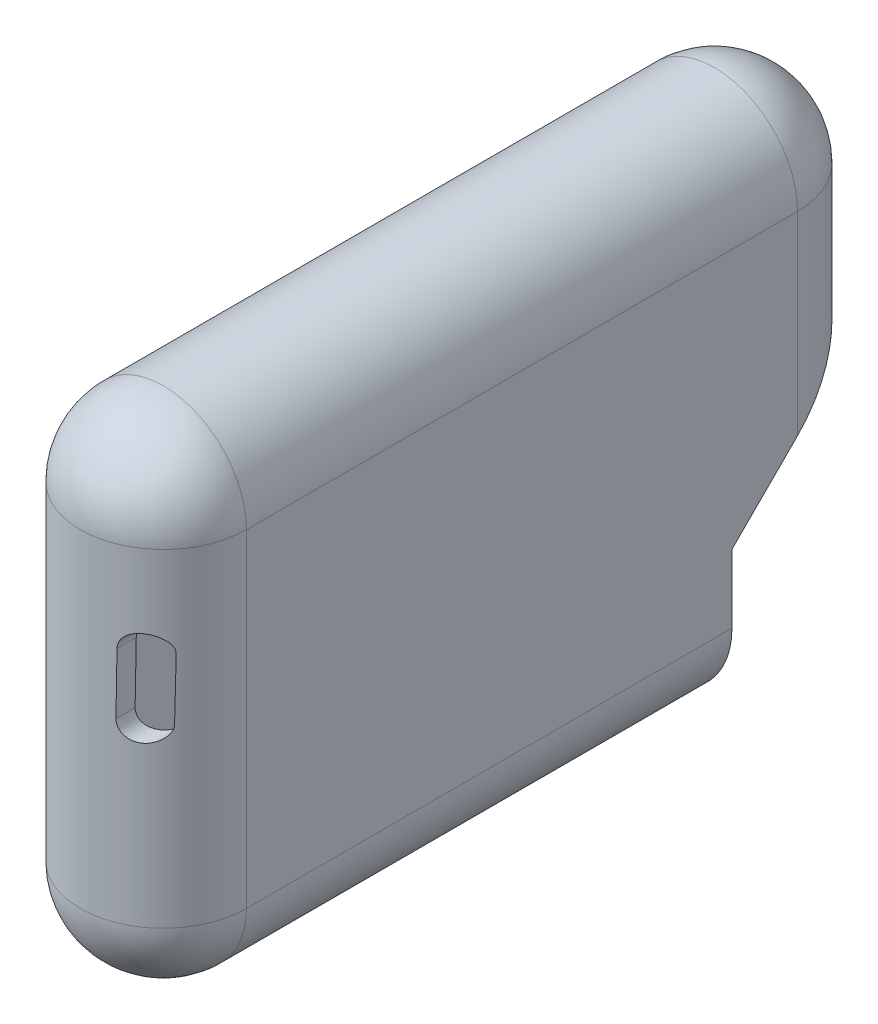
ISO-10303-21;
HEADER;
FILE_DESCRIPTION(('STEP AP214'),'2;1');
FILE_NAME('part.step','',(''),(''),'','','');
FILE_SCHEMA(('AUTOMOTIVE_DESIGN { 1 0 10303 214 1 1 1 1 }'));
ENDSEC;
DATA;
#1=APPLICATION_CONTEXT('core data for automotive mechanical design processes');
#2=APPLICATION_PROTOCOL_DEFINITION('international standard','automotive_design',2000,#1);
#3=PRODUCT_CONTEXT('',#1,'mechanical');
#4=PRODUCT('Part','Part','',(#3));
#5=PRODUCT_RELATED_PRODUCT_CATEGORY('part','',(#4));
#6=PRODUCT_DEFINITION_FORMATION('','',#4);
#7=PRODUCT_DEFINITION_CONTEXT('part definition',#1,'design');
#8=PRODUCT_DEFINITION('design','',#6,#7);
#9=PRODUCT_DEFINITION_SHAPE('','',#8);
#10=(LENGTH_UNIT() NAMED_UNIT(*) SI_UNIT(.MILLI.,.METRE.));
#11=(NAMED_UNIT(*) PLANE_ANGLE_UNIT() SI_UNIT($,.RADIAN.));
#12=(NAMED_UNIT(*) SI_UNIT($,.STERADIAN.) SOLID_ANGLE_UNIT());
#13=UNCERTAINTY_MEASURE_WITH_UNIT(LENGTH_MEASURE(1.E-05),#10,'distance_accuracy_value','');
#14=(GEOMETRIC_REPRESENTATION_CONTEXT(3) GLOBAL_UNCERTAINTY_ASSIGNED_CONTEXT((#13)) GLOBAL_UNIT_ASSIGNED_CONTEXT((#10,
#11,#12)) REPRESENTATION_CONTEXT('',''));
#15=CARTESIAN_POINT('',(0.,0.,0.));
#16=DIRECTION('',(0.,0.,1.));
#17=DIRECTION('',(1.,0.,0.));
#18=AXIS2_PLACEMENT_3D('',#15,#16,#17);
#19=CARTESIAN_POINT('',(-1.10874506068292,18.0382332785835,-55.));
#20=DIRECTION('',(0.,0.,1.));
#21=DIRECTION('',(1.,0.,0.));
#22=AXIS2_PLACEMENT_3D('',#19,#20,#21);
#23=CYLINDRICAL_SURFACE('',#22,9.5);
#24=DIRECTION('',(0.,0.,1.));
#25=VECTOR('',#24,1.);
#26=CARTESIAN_POINT('',(-10.6087450606829,18.0382332785835,-55.));
#27=LINE('',#26,#25);
#28=CARTESIAN_POINT('',(-10.6087450606829,18.0382332785835,-54.9999999999999));
#29=VERTEX_POINT('',#28);
#30=CARTESIAN_POINT('',(-10.6087450606829,18.0382332785835,7.99999999999999));
#31=VERTEX_POINT('',#30);
#32=EDGE_CURVE('E382',#29,#31,#27,.T.);
#33=ORIENTED_EDGE('',*,*,#32,.T.);
#34=CARTESIAN_POINT('',(-1.10874506068292,18.0382332785835,7.99999999999999));
#35=DIRECTION('',(0.,0.,1.));
#36=DIRECTION('',(1.,0.,0.));
#37=AXIS2_PLACEMENT_3D('',#34,#35,#36);
#38=CIRCLE('',#37,9.5);
#39=CARTESIAN_POINT('',(8.39125493931708,18.0382332785835,7.99999999999999));
#40=VERTEX_POINT('',#39);
#41=EDGE_CURVE('E346',#40,#31,#38,.T.);
#42=ORIENTED_EDGE('',*,*,#41,.F.);
#43=DIRECTION('',(0.,0.,1.));
#44=VECTOR('',#43,1.);
#45=CARTESIAN_POINT('',(8.39125493931708,18.0382332785835,-55.));
#46=LINE('',#45,#44);
#47=CARTESIAN_POINT('',(8.39125493931708,18.0382332785835,-55.));
#48=VERTEX_POINT('',#47);
#49=EDGE_CURVE('E383',#48,#40,#46,.T.);
#50=ORIENTED_EDGE('',*,*,#49,.F.);
#51=CARTESIAN_POINT('',(-1.10874506068292,18.0382332785835,-55.));
#52=DIRECTION('',(0.,0.,1.));
#53=DIRECTION('',(1.,0.,0.));
#54=AXIS2_PLACEMENT_3D('',#51,#52,#53);
#55=CIRCLE('',#54,9.5);
#56=EDGE_CURVE('E370',#48,#29,#55,.T.);
#57=ORIENTED_EDGE('',*,*,#56,.T.);
#58=EDGE_LOOP('',(#33,#42,#50,#57));
#59=FACE_BOUND('',#58,.T.);
#60=ADVANCED_FACE('F85',(#59),#23,.T.);
#61=CARTESIAN_POINT('',(8.39125493931708,18.0382332785835,-55.));
#62=DIRECTION('',(1.,0.,0.));
#63=DIRECTION('',(0.,1.,0.));
#64=AXIS2_PLACEMENT_3D('',#61,#62,#63);
#65=PLANE('',#64);
#66=DIRECTION('',(0.,-1.,0.));
#67=VECTOR('',#66,1.);
#68=CARTESIAN_POINT('',(8.39125493931708,18.0382332785835,-47.502612286271));
#69=LINE('',#68,#67);
#70=CARTESIAN_POINT('',(8.39125493931708,-11.6528868095049,-47.502612286271));
#71=VERTEX_POINT('',#70);
#72=CARTESIAN_POINT('',(8.39125493931708,-19.4617667214165,-47.502612286271));
#73=VERTEX_POINT('',#72);
#74=EDGE_CURVE('E231',#71,#73,#69,.T.);
#75=ORIENTED_EDGE('',*,*,#74,.F.);
#76=DIRECTION('',(0.,-0.707106781186548,0.707106781186547));
#77=VECTOR('',#76,1.);
#78=CARTESIAN_POINT('',(8.39125493931708,6.94136709140377,-66.0968661871797));
#79=LINE('',#78,#77);
#80=CARTESIAN_POINT('',(8.39125493931708,-4.15549909577594,-55.));
#81=VERTEX_POINT('',#80);
#82=EDGE_CURVE('E201',#81,#71,#79,.T.);
#83=ORIENTED_EDGE('',*,*,#82,.F.);
#84=DIRECTION('',(0.,1.,0.));
#85=VECTOR('',#84,1.);
#86=CARTESIAN_POINT('',(8.39125493931708,18.0382332785835,-55.));
#87=LINE('',#86,#85);
#88=EDGE_CURVE('E380',#81,#48,#87,.T.);
#89=ORIENTED_EDGE('',*,*,#88,.T.);
#90=ORIENTED_EDGE('',*,*,#49,.T.);
#91=DIRECTION('',(0.,1.,0.));
#92=VECTOR('',#91,1.);
#93=CARTESIAN_POINT('',(8.39125493931708,18.0382332785835,7.99999999999999));
#94=LINE('',#93,#92);
#95=CARTESIAN_POINT('',(8.39125493931708,-19.4617667214165,7.99999999999999));
#96=VERTEX_POINT('',#95);
#97=EDGE_CURVE('E355',#96,#40,#94,.T.);
#98=ORIENTED_EDGE('',*,*,#97,.F.);
#99=DIRECTION('',(0.,0.,1.));
#100=VECTOR('',#99,1.);
#101=CARTESIAN_POINT('',(8.39125493931708,-19.4617667214165,-55.));
#102=LINE('',#101,#100);
#103=EDGE_CURVE('E385',#73,#96,#102,.T.);
#104=ORIENTED_EDGE('',*,*,#103,.F.);
#105=EDGE_LOOP('',(#75,#83,#89,#90,#98,#104));
#106=FACE_BOUND('',#105,.T.);
#107=ADVANCED_FACE('F407',(#106),#65,.T.);
#108=CARTESIAN_POINT('',(-1.10874506068292,-19.4617667214165,-55.));
#109=DIRECTION('',(0.,0.,1.));
#110=DIRECTION('',(1.,0.,0.));
#111=AXIS2_PLACEMENT_3D('',#108,#109,#110);
#112=CYLINDRICAL_SURFACE('',#111,9.5);
#113=CARTESIAN_POINT('',(-1.10874506068292,-19.4617667214165,-47.502612286271));
#114=DIRECTION('',(0.,0.,1.));
#115=DIRECTION('',(1.,0.,0.));
#116=AXIS2_PLACEMENT_3D('',#113,#114,#115);
#117=CIRCLE('',#116,9.5);
#118=CARTESIAN_POINT('',(-10.6087450606829,-19.4617667214165,-47.502612286271));
#119=VERTEX_POINT('',#118);
#120=EDGE_CURVE('E208',#73,#119,#117,.F.);
#121=ORIENTED_EDGE('',*,*,#120,.F.);
#122=ORIENTED_EDGE('',*,*,#103,.T.);
#123=CARTESIAN_POINT('',(-1.10874506068292,-19.4617667214165,7.99999999999999));
#124=DIRECTION('',(0.,0.,1.));
#125=DIRECTION('',(1.,0.,0.));
#126=AXIS2_PLACEMENT_3D('',#123,#124,#125);
#127=CIRCLE('',#126,9.5);
#128=CARTESIAN_POINT('',(-10.6087450606829,-19.4617667214165,7.99999999999993));
#129=VERTEX_POINT('',#128);
#130=EDGE_CURVE('E352',#129,#96,#127,.T.);
#131=ORIENTED_EDGE('',*,*,#130,.F.);
#132=DIRECTION('',(0.,0.,1.));
#133=VECTOR('',#132,1.);
#134=CARTESIAN_POINT('',(-10.6087450606829,-19.4617667214165,-55.));
#135=LINE('',#134,#133);
#136=EDGE_CURVE('E387',#119,#129,#135,.T.);
#137=ORIENTED_EDGE('',*,*,#136,.F.);
#138=EDGE_LOOP('',(#121,#122,#131,#137));
#139=FACE_BOUND('',#138,.T.);
#140=ADVANCED_FACE('F411',(#139),#112,.T.);
#141=CARTESIAN_POINT('',(-10.6087450606829,18.0382332785835,-55.));
#142=DIRECTION('',(-1.,0.,0.));
#143=DIRECTION('',(0.,-1.,0.));
#144=AXIS2_PLACEMENT_3D('',#141,#142,#143);
#145=PLANE('',#144);
#146=DIRECTION('',(0.,-1.,0.));
#147=VECTOR('',#146,1.);
#148=CARTESIAN_POINT('',(-10.6087450606829,-35.0617949049496,-47.502612286271));
#149=LINE('',#148,#147);
#150=CARTESIAN_POINT('',(-10.6087450606829,-11.6528868095049,-47.502612286271));
#151=VERTEX_POINT('',#150);
#152=EDGE_CURVE('E205',#151,#119,#149,.T.);
#153=ORIENTED_EDGE('',*,*,#152,.T.);
#154=ORIENTED_EDGE('',*,*,#136,.T.);
#155=DIRECTION('',(0.,-1.,0.));
#156=VECTOR('',#155,1.);
#157=CARTESIAN_POINT('',(-10.6087450606829,18.0382332785835,7.99999999999999));
#158=LINE('',#157,#156);
#159=EDGE_CURVE('E349',#31,#129,#158,.T.);
#160=ORIENTED_EDGE('',*,*,#159,.F.);
#161=ORIENTED_EDGE('',*,*,#32,.F.);
#162=DIRECTION('',(0.,-1.,0.));
#163=VECTOR('',#162,1.);
#164=CARTESIAN_POINT('',(-10.6087450606829,18.0382332785835,-55.));
#165=LINE('',#164,#163);
#166=CARTESIAN_POINT('',(-10.6087450606829,-4.15549909577595,-55.));
#167=VERTEX_POINT('',#166);
#168=EDGE_CURVE('E216',#29,#167,#165,.T.);
#169=ORIENTED_EDGE('',*,*,#168,.T.);
#170=DIRECTION('',(0.,-0.707106781186548,0.707106781186547));
#171=VECTOR('',#170,1.);
#172=CARTESIAN_POINT('',(-10.6087450606829,-11.6528868095049,-47.502612286271));
#173=LINE('',#172,#171);
#174=EDGE_CURVE('E106',#167,#151,#173,.T.);
#175=ORIENTED_EDGE('',*,*,#174,.T.);
#176=EDGE_LOOP('',(#153,#154,#160,#161,#169,#175));
#177=FACE_BOUND('',#176,.T.);
#178=ADVANCED_FACE('F213',(#177),#145,.T.);
#179=CARTESIAN_POINT('',(-1.10874506068292,18.0382332785835,-55.));
#180=DIRECTION('',(0.,0.,1.));
#181=DIRECTION('',(1.,0.,0.));
#182=AXIS2_PLACEMENT_3D('',#179,#180,#181);
#183=CYLINDRICAL_SURFACE('',#182,7.5);
#184=DIRECTION('',(0.,0.,1.));
#185=VECTOR('',#184,1.);
#186=CARTESIAN_POINT('',(6.39125493931708,18.0382332785835,-55.));
#187=LINE('',#186,#185);
#188=CARTESIAN_POINT('',(6.39125493931708,18.0382332785835,-55.));
#189=VERTEX_POINT('',#188);
#190=CARTESIAN_POINT('',(6.39125493931708,18.0382332785835,7.99999999999999));
#191=VERTEX_POINT('',#190);
#192=EDGE_CURVE('E367',#189,#191,#187,.T.);
#193=ORIENTED_EDGE('',*,*,#192,.T.);
#194=CARTESIAN_POINT('',(-1.10874506068292,18.0382332785835,7.99999999999999));
#195=DIRECTION('',(0.,0.,1.));
#196=DIRECTION('',(1.,0.,0.));
#197=AXIS2_PLACEMENT_3D('',#194,#195,#196);
#198=CIRCLE('',#197,7.5);
#199=CARTESIAN_POINT('',(-8.60874506068292,18.0382332785835,7.99999999999994));
#200=VERTEX_POINT('',#199);
#201=EDGE_CURVE('E334',#191,#200,#198,.T.);
#202=ORIENTED_EDGE('',*,*,#201,.T.);
#203=DIRECTION('',(0.,0.,1.));
#204=VECTOR('',#203,1.);
#205=CARTESIAN_POINT('',(-8.60874506068292,18.0382332785835,-55.));
#206=LINE('',#205,#204);
#207=CARTESIAN_POINT('',(-8.60874506068292,18.0382332785835,-55.));
#208=VERTEX_POINT('',#207);
#209=EDGE_CURVE('E366',#208,#200,#206,.T.);
#210=ORIENTED_EDGE('',*,*,#209,.F.);
#211=CARTESIAN_POINT('',(-1.10874506068292,18.0382332785835,-55.));
#212=DIRECTION('',(0.,0.,1.));
#213=DIRECTION('',(1.,0.,0.));
#214=AXIS2_PLACEMENT_3D('',#211,#212,#213);
#215=CIRCLE('',#214,7.5);
#216=EDGE_CURVE('E358',#189,#208,#215,.T.);
#217=ORIENTED_EDGE('',*,*,#216,.F.);
#218=EDGE_LOOP('',(#193,#202,#210,#217));
#219=FACE_BOUND('',#218,.T.);
#220=ADVANCED_FACE('F421',(#219),#183,.F.);
#221=CARTESIAN_POINT('',(6.39125493931708,18.0382332785835,-55.));
#222=DIRECTION('',(1.,0.,0.));
#223=DIRECTION('',(0.,1.,0.));
#224=AXIS2_PLACEMENT_3D('',#221,#222,#223);
#225=PLANE('',#224);
#226=DIRECTION('',(0.,-0.707106781186548,0.707106781186547));
#227=VECTOR('',#226,1.);
#228=CARTESIAN_POINT('',(6.39125493931708,6.94136709140376,-66.0968661871797));
#229=LINE('',#228,#227);
#230=CARTESIAN_POINT('',(6.39125493931708,-4.15549909577594,-55.));
#231=VERTEX_POINT('',#230);
#232=CARTESIAN_POINT('',(6.39125493931708,-11.6528868095049,-47.502612286271));
#233=VERTEX_POINT('',#232);
#234=EDGE_CURVE('E99',#231,#233,#229,.T.);
#235=ORIENTED_EDGE('',*,*,#234,.T.);
#236=DIRECTION('',(0.,-1.,0.));
#237=VECTOR('',#236,1.);
#238=CARTESIAN_POINT('',(6.39125493931708,18.0382332785835,-47.502612286271));
#239=LINE('',#238,#237);
#240=CARTESIAN_POINT('',(6.39125493931708,-19.4617667214165,-47.502612286271));
#241=VERTEX_POINT('',#240);
#242=EDGE_CURVE('E227',#233,#241,#239,.T.);
#243=ORIENTED_EDGE('',*,*,#242,.T.);
#244=DIRECTION('',(0.,0.,1.));
#245=VECTOR('',#244,1.);
#246=CARTESIAN_POINT('',(6.39125493931708,-19.4617667214165,-55.));
#247=LINE('',#246,#245);
#248=CARTESIAN_POINT('',(6.39125493931708,-19.4617667214165,7.99999999999999));
#249=VERTEX_POINT('',#248);
#250=EDGE_CURVE('E371',#241,#249,#247,.T.);
#251=ORIENTED_EDGE('',*,*,#250,.T.);
#252=DIRECTION('',(0.,1.,0.));
#253=VECTOR('',#252,1.);
#254=CARTESIAN_POINT('',(6.39125493931708,18.0382332785835,7.99999999999999));
#255=LINE('',#254,#253);
#256=EDGE_CURVE('E343',#249,#191,#255,.T.);
#257=ORIENTED_EDGE('',*,*,#256,.T.);
#258=ORIENTED_EDGE('',*,*,#192,.F.);
#259=DIRECTION('',(0.,1.,0.));
#260=VECTOR('',#259,1.);
#261=CARTESIAN_POINT('',(6.39125493931708,18.0382332785835,-55.));
#262=LINE('',#261,#260);
#263=EDGE_CURVE('E364',#231,#189,#262,.T.);
#264=ORIENTED_EDGE('',*,*,#263,.F.);
#265=EDGE_LOOP('',(#235,#243,#251,#257,#258,#264));
#266=FACE_BOUND('',#265,.T.);
#267=ADVANCED_FACE('F427',(#266),#225,.F.);
#268=CARTESIAN_POINT('',(-1.10874506068292,-19.4617667214165,-55.));
#269=DIRECTION('',(0.,0.,1.));
#270=DIRECTION('',(1.,0.,0.));
#271=AXIS2_PLACEMENT_3D('',#268,#269,#270);
#272=CYLINDRICAL_SURFACE('',#271,7.5);
#273=ORIENTED_EDGE('',*,*,#250,.F.);
#274=CARTESIAN_POINT('',(-1.10874506068292,-19.4617667214165,-47.502612286271));
#275=DIRECTION('',(0.,0.,1.));
#276=DIRECTION('',(1.,0.,0.));
#277=AXIS2_PLACEMENT_3D('',#274,#275,#276);
#278=CIRCLE('',#277,7.5);
#279=CARTESIAN_POINT('',(-8.60874506068292,-19.4617667214165,-47.502612286271));
#280=VERTEX_POINT('',#279);
#281=EDGE_CURVE('E224',#241,#280,#278,.F.);
#282=ORIENTED_EDGE('',*,*,#281,.T.);
#283=DIRECTION('',(0.,0.,1.));
#284=VECTOR('',#283,1.);
#285=CARTESIAN_POINT('',(-8.60874506068292,-19.4617667214165,-55.));
#286=LINE('',#285,#284);
#287=CARTESIAN_POINT('',(-8.60874506068292,-19.4617667214165,7.99999999999994));
#288=VERTEX_POINT('',#287);
#289=EDGE_CURVE('E373',#280,#288,#286,.T.);
#290=ORIENTED_EDGE('',*,*,#289,.T.);
#291=CARTESIAN_POINT('',(-1.10874506068292,-19.4617667214165,7.99999999999999));
#292=DIRECTION('',(0.,0.,1.));
#293=DIRECTION('',(1.,0.,0.));
#294=AXIS2_PLACEMENT_3D('',#291,#292,#293);
#295=CIRCLE('',#294,7.5);
#296=EDGE_CURVE('E340',#288,#249,#295,.T.);
#297=ORIENTED_EDGE('',*,*,#296,.T.);
#298=EDGE_LOOP('',(#273,#282,#290,#297));
#299=FACE_BOUND('',#298,.T.);
#300=ADVANCED_FACE('F432',(#299),#272,.F.);
#301=CARTESIAN_POINT('',(-8.60874506068292,18.0382332785835,-55.));
#302=DIRECTION('',(-1.,0.,0.));
#303=DIRECTION('',(0.,-1.,0.));
#304=AXIS2_PLACEMENT_3D('',#301,#302,#303);
#305=PLANE('',#304);
#306=ORIENTED_EDGE('',*,*,#289,.F.);
#307=DIRECTION('',(0.,1.,0.));
#308=VECTOR('',#307,1.);
#309=CARTESIAN_POINT('',(-8.60874506068292,18.0382332785835,-47.502612286271));
#310=LINE('',#309,#308);
#311=CARTESIAN_POINT('',(-8.60874506068292,-11.6528868095049,-47.502612286271));
#312=VERTEX_POINT('',#311);
#313=EDGE_CURVE('E12',#280,#312,#310,.T.);
#314=ORIENTED_EDGE('',*,*,#313,.T.);
#315=DIRECTION('',(0.,0.707106781186548,-0.707106781186547));
#316=VECTOR('',#315,1.);
#317=CARTESIAN_POINT('',(-8.60874506068292,6.94136709140376,-66.0968661871797));
#318=LINE('',#317,#316);
#319=CARTESIAN_POINT('',(-8.60874506068292,-4.15549909577594,-55.));
#320=VERTEX_POINT('',#319);
#321=EDGE_CURVE('E199',#312,#320,#318,.T.);
#322=ORIENTED_EDGE('',*,*,#321,.T.);
#323=DIRECTION('',(0.,-1.,0.));
#324=VECTOR('',#323,1.);
#325=CARTESIAN_POINT('',(-8.60874506068292,18.0382332785835,-55.));
#326=LINE('',#325,#324);
#327=EDGE_CURVE('E361',#208,#320,#326,.T.);
#328=ORIENTED_EDGE('',*,*,#327,.F.);
#329=ORIENTED_EDGE('',*,*,#209,.T.);
#330=DIRECTION('',(0.,-1.,0.));
#331=VECTOR('',#330,1.);
#332=CARTESIAN_POINT('',(-8.60874506068292,18.0382332785835,7.99999999999999));
#333=LINE('',#332,#331);
#334=EDGE_CURVE('E337',#200,#288,#333,.T.);
#335=ORIENTED_EDGE('',*,*,#334,.T.);
#336=EDGE_LOOP('',(#306,#314,#322,#328,#329,#335));
#337=FACE_BOUND('',#336,.T.);
#338=ADVANCED_FACE('F447',(#337),#305,.F.);
#339=CARTESIAN_POINT('',(-1.10874506068292,27.5382332785835,7.99999999999999));
#340=DIRECTION('',(0.,1.,0.));
#341=DIRECTION('',(-1.,0.,0.));
#342=AXIS2_PLACEMENT_3D('',#339,#340,#341);
#343=CYLINDRICAL_SURFACE('',#342,9.5);
#344=CARTESIAN_POINT('',(-1.10874506068291,-280.666307637473,7.99999999999999));
#345=DIRECTION('',(-0.999925340849709,0.0122193586817616,0.));
#346=DIRECTION('',(0.0122193586817616,0.999925340849709,0.));
#347=AXIS2_PLACEMENT_3D('',#344,#345,#346);
#348=ELLIPSE('',#347,777.454876922429,9.5);
#349=CARTESIAN_POINT('',(2.33000941161142,0.731253998851787,16.8557872422092));
#350=VERTEX_POINT('',#349);
#351=CARTESIAN_POINT('',(2.41500991267724,7.68695087413048,16.8223098385695));
#352=VERTEX_POINT('',#351);
#353=EDGE_CURVE('E247',#350,#352,#348,.T.);
#354=ORIENTED_EDGE('',*,*,#353,.T.);
#355=CARTESIAN_POINT('',(2.41500991267724,7.68695087413048,16.8223098385695));
#356=CARTESIAN_POINT('',(2.415631461381,7.73837961783971,16.8220581783112));
#357=CARTESIAN_POINT('',(2.41830670151873,7.78977629456757,16.8209928915721));
#358=CARTESIAN_POINT('',(2.42770533483002,7.89213187501115,16.8172308646044));
#359=CARTESIAN_POINT('',(2.43442823256512,7.94309083153023,16.8145343240432));
#360=CARTESIAN_POINT('',(2.45184634332149,8.04411272756149,16.8075122977817));
#361=CARTESIAN_POINT('',(2.46253388118147,8.09417720369151,16.8031899592452));
#362=CARTESIAN_POINT('',(2.48776184978994,8.19314008274039,16.792913188224));
#363=CARTESIAN_POINT('',(2.50230228141803,8.24203848539303,16.7869587553665));
#364=CARTESIAN_POINT('',(2.55150782726987,8.38648277465097,16.7666312930164));
#365=CARTESIAN_POINT('',(2.59177061113299,8.4798544544689,16.7497888710711));
#366=CARTESIAN_POINT('',(2.685543112757,8.6580576484819,16.7095328603141));
#367=CARTESIAN_POINT('',(2.73905323926475,8.74288889904834,16.6861190687398));
#368=CARTESIAN_POINT('',(2.85827750144554,8.9034817005485,16.6323270428262));
#369=CARTESIAN_POINT('',(2.92418992842269,8.97905725860744,16.6018334417092));
#370=CARTESIAN_POINT('',(3.06504631959681,9.11787445933531,16.5343750740447));
#371=CARTESIAN_POINT('',(3.13999299848648,9.18111237965859,16.4974083608807));
#372=CARTESIAN_POINT('',(3.30119343461014,9.29798484547075,16.4149347171556));
#373=CARTESIAN_POINT('',(3.38786128065199,9.35077073534017,16.3690381063347));
#374=CARTESIAN_POINT('',(3.56546848760969,9.44129148278149,16.2711560801561));
#375=CARTESIAN_POINT('',(3.65640927965765,9.4790212568811,16.2191686159638));
#376=CARTESIAN_POINT('',(3.85038505615658,9.54327347518387,16.1037733142607));
#377=CARTESIAN_POINT('',(3.95362428174676,9.56804497082772,16.039738849289));
#378=CARTESIAN_POINT('',(4.15937260952486,9.60053348866344,15.9064531136091));
#379=CARTESIAN_POINT('',(4.26188132894516,9.60824214370812,15.8371993006806));
#380=CARTESIAN_POINT('',(4.48030975614313,9.60788078072151,15.6832959841572));
#381=CARTESIAN_POINT('',(4.59573958279924,9.5970781228192,15.5979600620997));
#382=CARTESIAN_POINT('',(4.82050959274971,9.55616886859285,15.4238943532527));
#383=CARTESIAN_POINT('',(4.92984366575154,9.52604326836769,15.335161306301));
#384=CARTESIAN_POINT('',(5.15850215434192,9.44135520373851,15.1412655274879));
#385=CARTESIAN_POINT('',(5.27641155026684,9.38353357605985,15.0358507922502));
#386=CARTESIAN_POINT('',(5.49948696121845,9.24460980955491,14.8267554506172));
#387=CARTESIAN_POINT('',(5.60465414893199,9.16350981539377,14.7230746854));
#388=CARTESIAN_POINT('',(5.77440353525937,9.00160275720128,14.5485171486211));
#389=CARTESIAN_POINT('',(5.84245877936339,8.92611095636926,14.4760746196076));
#390=CARTESIAN_POINT('',(5.96834272771009,8.76126797775264,14.338254631537));
#391=CARTESIAN_POINT('',(6.02618549624103,8.67193618357036,14.2728675050686));
#392=CARTESIAN_POINT('',(6.11355051281591,8.50741872160561,14.1718329892822));
#393=CARTESIAN_POINT('',(6.1463851907208,8.43588894552919,14.1331153667558));
#394=CARTESIAN_POINT('',(6.20398319774304,8.28594358632892,14.0643228256432));
#395=CARTESIAN_POINT('',(6.22877962585008,8.20755797276689,14.0342125269821));
#396=CARTESIAN_POINT('',(6.25813020821004,8.0878698896175,13.998280755748));
#397=CARTESIAN_POINT('',(6.26646711611923,8.04878093245286,13.9880193474889));
#398=CARTESIAN_POINT('',(6.28079009742153,7.96954214704518,13.9703348932646));
#399=CARTESIAN_POINT('',(6.28677691542039,7.92939265913228,13.9629109482934));
#400=CARTESIAN_POINT('',(6.29630558704681,7.84781570397682,13.9510745368328));
#401=CARTESIAN_POINT('',(6.29981431112996,7.80637837893823,13.9467028848257));
#402=CARTESIAN_POINT('',(6.30417735113432,7.72309107022573,13.9412606818171));
#403=CARTESIAN_POINT('',(6.30502786216568,7.6812405809742,13.9401948627065));
#404=CARTESIAN_POINT('',(6.30450354148055,7.63942020779055,13.9408539085321));
#405=B_SPLINE_CURVE_WITH_KNOTS('',3,(#355,#356,#357,#358,#359,#360,#361,#362,#363,#364,#365,
#366,#367,#368,#369,#370,#371,#372,#373,#374,#375,#376,#377,#378,#379,#380,#381,#382,#383,#384,
#385,#386,#387,#388,#389,#390,#391,#392,#393,#394,#395,#396,#397,#398,#399,#400,#401,#402,#403,
#404),.UNSPECIFIED.,.F.,.F.,(4,2,2,2,2,2,2,2,2,2,2,2,2,2,2,2,2,2,2,2,2,2,2,2,4),(0.,
0.154246956100942,0.308475036015027,0.462406090252711,0.61633717963316,0.923968166130413,
1.23160864576718,1.5446658645824,1.85781738923077,2.19056630295981,2.52342746951804,
2.8939482999675,3.26465078341474,3.69488322349314,4.12553944258716,4.62866737245332,
5.13174896338182,5.5051263447683,5.87798544255239,6.14032198472956,6.4015641655284,
6.52520994749363,6.6488165216752,6.77404581520316,6.89945427644723),.UNSPECIFIED.);
#406=CARTESIAN_POINT('',(6.30450354148055,7.63942020779055,13.9408539085321));
#407=VERTEX_POINT('',#406);
#408=EDGE_CURVE('E315',#352,#407,#405,.T.);
#409=ORIENTED_EDGE('',*,*,#408,.T.);
#410=CARTESIAN_POINT('',(-1.10874506068289,-598.995946539073,7.99999999999999));
#411=DIRECTION('',(0.999925340849709,-0.0122193586817616,0.));
#412=DIRECTION('',(0.0122193586817616,0.999925340849709,0.));
#413=AXIS2_PLACEMENT_3D('',#410,#411,#412);
#414=ELLIPSE('',#413,777.454876922429,9.5);
#415=CARTESIAN_POINT('',(6.21950304041473,0.683723332511852,14.0453932683291));
#416=VERTEX_POINT('',#415);
#417=EDGE_CURVE('E262',#407,#416,#414,.T.);
#418=ORIENTED_EDGE('',*,*,#417,.T.);
#419=CARTESIAN_POINT('',(6.21950304041473,0.683723332511851,14.0453932683291));
#420=CARTESIAN_POINT('',(6.21899219500899,0.640844489239133,14.046007811789));
#421=CARTESIAN_POINT('',(6.21703804229198,0.598026655838216,14.0483811424328));
#422=CARTESIAN_POINT('',(6.21036380866054,0.512987340677641,14.0564583496497));
#423=CARTESIAN_POINT('',(6.20564793511476,0.470765051618059,14.0621571599438));
#424=CARTESIAN_POINT('',(6.19364390741713,0.387778388241846,14.0766106999961));
#425=CARTESIAN_POINT('',(6.18638852186705,0.347002405522789,14.085326485085));
#426=CARTESIAN_POINT('',(6.16947553240184,0.266658924344074,14.1055450211247));
#427=CARTESIAN_POINT('',(6.15981714552279,0.227091824498971,14.1170486804097));
#428=CARTESIAN_POINT('',(6.12766062655746,0.11103443296436,14.1551219580901));
#429=CARTESIAN_POINT('',(6.10189428789453,0.0366176764251102,14.1853604226541));
#430=CARTESIAN_POINT('',(6.04310227070936,-0.105862070190932,14.25324787716));
#431=CARTESIAN_POINT('',(6.01004983126525,-0.17390028423547,14.2909241304267));
#432=CARTESIAN_POINT('',(5.91674317175173,-0.341486115464339,14.3952974755205));
#433=CARTESIAN_POINT('',(5.8519319570561,-0.435996063422988,14.4660194243332));
#434=CARTESIAN_POINT('',(5.71066414317755,-0.609056461777367,14.6148530260029));
#435=CARTESIAN_POINT('',(5.63418469087709,-0.687574871080928,14.6929790640179));
#436=CARTESIAN_POINT('',(5.44809502697422,-0.849815598692778,14.8759991182908));
#437=CARTESIAN_POINT('',(5.33528976079935,-0.928512695468917,14.9821170675448));
#438=CARTESIAN_POINT('',(5.09645544906159,-1.06056926862614,15.195218563593));
#439=CARTESIAN_POINT('',(4.97041992361697,-1.11391625773882,15.302202510637));
#440=CARTESIAN_POINT('',(4.70709055164132,-1.1937453359279,15.5136323010979));
#441=CARTESIAN_POINT('',(4.5697518108717,-1.22011409966532,15.6180656536625));
#442=CARTESIAN_POINT('',(4.28792136370772,-1.24246670233115,15.8202230636204));
#443=CARTESIAN_POINT('',(4.14344330017755,-1.23850642523657,15.9179591261184));
#444=CARTESIAN_POINT('',(3.88947051236774,-1.20201990523319,16.0798856709185));
#445=CARTESIAN_POINT('',(3.78032888614732,-1.17693890088694,16.1463255142311));
#446=CARTESIAN_POINT('',(3.5643960229457,-1.10658439007082,16.2720801257573));
#447=CARTESIAN_POINT('',(3.45760367377302,-1.06132066417999,16.3313983274786));
#448=CARTESIAN_POINT('',(3.24985885657854,-0.949672300561164,16.4419502042206));
#449=CARTESIAN_POINT('',(3.14895020326255,-0.883148484905784,16.4931271800797));
#450=CARTESIAN_POINT('',(2.95877979877514,-0.729764268302609,16.5858279951172));
#451=CARTESIAN_POINT('',(2.86951018977798,-0.642917699648931,16.6273583619354));
#452=CARTESIAN_POINT('',(2.71733088743116,-0.462663679340105,16.6958202079625));
#453=CARTESIAN_POINT('',(2.6525478949849,-0.371270095732984,16.723901411855));
#454=CARTESIAN_POINT('',(2.53899956744265,-0.177038334146117,16.7719884509651));
#455=CARTESIAN_POINT('',(2.49023465506383,-0.0741998542313887,16.7919940730712));
#456=CARTESIAN_POINT('',(2.41432882571601,0.130926301664463,16.8226692383747));
#457=CARTESIAN_POINT('',(2.38577200890354,0.232602086797062,16.8339567777484));
#458=CARTESIAN_POINT('',(2.34553937049718,0.439569309793571,16.8497690053133));
#459=CARTESIAN_POINT('',(2.33382053205842,0.544850828050044,16.8543109278808));
#460=CARTESIAN_POINT('',(2.32990838725348,0.677270460835731,16.8558255179202));
#461=CARTESIAN_POINT('',(2.32967494447659,0.704272431789275,16.8559155700377));
#462=CARTESIAN_POINT('',(2.33000941161142,0.731253998851787,16.8557872422092));
#463=B_SPLINE_CURVE_WITH_KNOTS('',3,(#419,#420,#421,#422,#423,#424,#425,#426,#427,#428,#429,
#430,#431,#432,#433,#434,#435,#436,#437,#438,#439,#440,#441,#442,#443,#444,#445,#446,#447,#448,
#449,#450,#451,#452,#453,#454,#455,#456,#457,#458,#459,#460,#461,#462),.UNSPECIFIED.,.F.,.F.,(4,
2,2,2,2,2,2,2,2,2,2,2,2,2,2,2,2,2,2,2,2,4),(0.,0.128572268350684,0.256949169801231,
0.383727170955909,0.510546534091171,0.76244935099853,1.01529326495569,1.41702492522645,
1.81955375474647,2.33812463880162,2.85695070277287,3.37794732057015,3.89798418667383,
4.28705477186606,4.67593701739944,5.06741908163138,5.45863546211581,5.80324986285761,
6.14787335724398,6.46497492965,6.78126493715296,6.86224434213753),.UNSPECIFIED.);
#464=EDGE_CURVE('E253',#416,#350,#463,.T.);
#465=ORIENTED_EDGE('',*,*,#464,.T.);
#466=EDGE_LOOP('',(#354,#409,#418,#465));
#467=FACE_BOUND('',#466,.T.);
#468=ORIENTED_EDGE('',*,*,#159,.T.);
#469=CARTESIAN_POINT('',(-1.10874506068292,-19.4617667214165,7.99999999999999));
#470=DIRECTION('',(0.,1.,0.));
#471=DIRECTION('',(-1.,0.,0.));
#472=AXIS2_PLACEMENT_3D('',#469,#470,#471);
#473=CIRCLE('',#472,9.5);
#474=EDGE_CURVE('E325',#129,#96,#473,.T.);
#475=ORIENTED_EDGE('',*,*,#474,.T.);
#476=ORIENTED_EDGE('',*,*,#97,.T.);
#477=CARTESIAN_POINT('',(-1.10874506068292,18.0382332785835,7.99999999999999));
#478=DIRECTION('',(0.,1.,0.));
#479=DIRECTION('',(-1.,0.,0.));
#480=AXIS2_PLACEMENT_3D('',#477,#478,#479);
#481=CIRCLE('',#480,9.5);
#482=EDGE_CURVE('E322',#31,#40,#481,.T.);
#483=ORIENTED_EDGE('',*,*,#482,.F.);
#484=EDGE_LOOP('',(#468,#475,#476,#483));
#485=FACE_BOUND('',#484,.T.);
#486=ADVANCED_FACE('F264',(#467,#485),#343,.T.);
#487=CARTESIAN_POINT('',(-1.10874506068292,-19.4617667214165,7.99999999999999));
#488=DIRECTION('',(0.,1.,0.));
#489=DIRECTION('',(1.,0.,0.));
#490=AXIS2_PLACEMENT_3D('',#487,#488,#489);
#491=SPHERICAL_SURFACE('',#490,9.5);
#492=ORIENTED_EDGE('',*,*,#474,.F.);
#493=ORIENTED_EDGE('',*,*,#130,.T.);
#494=EDGE_LOOP('',(#492,#493));
#495=FACE_BOUND('',#494,.T.);
#496=ADVANCED_FACE('F399',(#495),#491,.T.);
#497=CARTESIAN_POINT('',(-1.10874506068292,18.0382332785835,7.99999999999999));
#498=DIRECTION('',(0.,1.,0.));
#499=DIRECTION('',(-1.,0.,0.));
#500=AXIS2_PLACEMENT_3D('',#497,#498,#499);
#501=SPHERICAL_SURFACE('',#500,9.5);
#502=ORIENTED_EDGE('',*,*,#482,.T.);
#503=ORIENTED_EDGE('',*,*,#41,.T.);
#504=EDGE_LOOP('',(#502,#503));
#505=FACE_BOUND('',#504,.T.);
#506=ADVANCED_FACE('F313',(#505),#501,.T.);
#507=CARTESIAN_POINT('',(-1.10874506068292,18.0382332785835,7.99999999999999));
#508=DIRECTION('',(0.,1.,0.));
#509=DIRECTION('',(-1.,0.,0.));
#510=AXIS2_PLACEMENT_3D('',#507,#508,#509);
#511=SPHERICAL_SURFACE('',#510,7.5);
#512=CARTESIAN_POINT('',(-1.10874506068292,18.0382332785835,7.99999999999999));
#513=DIRECTION('',(0.,1.,0.));
#514=DIRECTION('',(-1.,0.,0.));
#515=AXIS2_PLACEMENT_3D('',#512,#513,#514);
#516=CIRCLE('',#515,7.5);
#517=EDGE_CURVE('E331',#200,#191,#516,.T.);
#518=ORIENTED_EDGE('',*,*,#517,.F.);
#519=ORIENTED_EDGE('',*,*,#201,.F.);
#520=EDGE_LOOP('',(#518,#519));
#521=FACE_BOUND('',#520,.T.);
#522=ADVANCED_FACE('F299',(#521),#511,.F.);
#523=CARTESIAN_POINT('',(-1.10874506068292,27.5382332785835,7.99999999999999));
#524=DIRECTION('',(0.,1.,0.));
#525=DIRECTION('',(-1.,0.,0.));
#526=AXIS2_PLACEMENT_3D('',#523,#524,#525);
#527=CYLINDRICAL_SURFACE('',#526,7.5);
#528=CARTESIAN_POINT('',(-1.10874506068289,-598.995946539073,7.99999999999999));
#529=DIRECTION('',(0.999925340849709,-0.0122193586817616,0.));
#530=DIRECTION('',(0.0122193586817616,0.999925340849709,0.));
#531=AXIS2_PLACEMENT_3D('',#528,#529,#530);
#532=ELLIPSE('',#531,613.780165991391,7.5);
#533=CARTESIAN_POINT('',(6.21950304041473,0.683723332511852,9.59586333022557));
#534=VERTEX_POINT('',#533);
#535=CARTESIAN_POINT('',(6.30450354148055,7.63942020779055,9.1374291901131));
#536=VERTEX_POINT('',#535);
#537=EDGE_CURVE('E289',#534,#536,#532,.F.);
#538=ORIENTED_EDGE('',*,*,#537,.T.);
#539=CARTESIAN_POINT('',(6.30450354148055,7.63942020779055,9.13742919011307));
#540=CARTESIAN_POINT('',(6.30473693435578,7.657690757582,9.13589352765368));
#541=CARTESIAN_POINT('',(6.30469403463346,7.6760425170073,9.13618484691832));
#542=CARTESIAN_POINT('',(6.30411278547357,7.71211368337293,9.13997831269793));
#543=CARTESIAN_POINT('',(6.30358244843615,7.72983851623005,9.14342853032724));
#544=CARTESIAN_POINT('',(6.3018713109042,7.76949374954626,9.15446927798186));
#545=CARTESIAN_POINT('',(6.30054673057449,7.79115757793102,9.16296875534264));
#546=CARTESIAN_POINT('',(6.29733859647866,7.8329574724388,9.18323037775712));
#547=CARTESIAN_POINT('',(6.29545132074291,7.85308220798348,9.19501421237477));
#548=CARTESIAN_POINT('',(6.28821425646538,7.92003638539829,9.2393454781038));
#549=CARTESIAN_POINT('',(6.28181997363107,7.96314719617029,9.27717025525506));
#550=CARTESIAN_POINT('',(6.26743255865119,8.04404560147673,9.35784629165054));
#551=CARTESIAN_POINT('',(6.25942863131516,8.08179414848766,9.40073063421004));
#552=CARTESIAN_POINT('',(6.24215938779552,8.15360500356775,9.48868780253434));
#553=CARTESIAN_POINT('',(6.23290441468194,8.1876938062756,9.53374091342734));
#554=CARTESIAN_POINT('',(6.21319177842095,8.2535767939452,9.62525202987535));
#555=CARTESIAN_POINT('',(6.20273320868304,8.28536921946943,9.67171107475714));
#556=CARTESIAN_POINT('',(6.16958572510883,8.37836543671115,9.81250777721891));
#557=CARTESIAN_POINT('',(6.14515780280052,8.43705940132857,9.90809522686474));
#558=CARTESIAN_POINT('',(6.09175156592924,8.55013850970097,10.1006870711292));
#559=CARTESIAN_POINT('',(6.06276655079502,8.60451712831915,10.1976933583875));
#560=CARTESIAN_POINT('',(6.00028628089288,8.70960753279169,10.3920880066585));
#561=CARTESIAN_POINT('',(5.96679587762447,8.76032317396476,10.4894758487752));
#562=CARTESIAN_POINT('',(5.87371279933247,8.88793271237916,10.7427849643553));
#563=CARTESIAN_POINT('',(5.81052881598847,8.9622427007242,10.8987107672722));
#564=CARTESIAN_POINT('',(5.67203866261489,9.10200206200024,11.2093512669067));
#565=CARTESIAN_POINT('',(5.59672171188913,9.16744345867292,11.3640647570231));
#566=CARTESIAN_POINT('',(5.43398842361582,9.28763181023655,11.670506333185));
#567=CARTESIAN_POINT('',(5.3466180172053,9.3424175453954,11.8222433664212));
#568=CARTESIAN_POINT('',(5.1594799049685,9.43917217135227,12.1219562382807));
#569=CARTESIAN_POINT('',(5.05972578574701,9.48115493689899,12.2699359880811));
#570=CARTESIAN_POINT('',(4.84181605663847,9.55105888595915,12.5691345903218));
#571=CARTESIAN_POINT('',(4.72293404587062,9.57803780516949,12.7200541316879));
#572=CARTESIAN_POINT('',(4.47248756637485,9.60889428817547,13.0136731094703));
#573=CARTESIAN_POINT('',(4.34093407745723,9.61279167229624,13.156379494273));
#574=CARTESIAN_POINT('',(4.09521565476259,9.59312302838764,13.4030423829173));
#575=CARTESIAN_POINT('',(3.98275182140664,9.57483194859506,13.5090835427476));
#576=CARTESIAN_POINT('',(3.75490599544962,9.51536424946129,13.7112119051498));
#577=CARTESIAN_POINT('',(3.639528825736,9.47422335408665,13.8073143686104));
#578=CARTESIAN_POINT('',(3.4357027849508,9.37741312303067,13.9675002931739));
#579=CARTESIAN_POINT('',(3.34679817646172,9.32676990273361,14.034025283053));
#580=CARTESIAN_POINT('',(3.17400221482116,9.20835183023408,14.1578687017486));
#581=CARTESIAN_POINT('',(3.09010916600207,9.14058281362541,14.2151902557659));
#582=CARTESIAN_POINT('',(2.9310672564653,8.98746592046243,14.3197359269824));
#583=CARTESIAN_POINT('',(2.85598766948508,8.9019917165907,14.3668822140776));
#584=CARTESIAN_POINT('',(2.72003833280527,8.71542858262307,14.4495566986962));
#585=CARTESIAN_POINT('',(2.65916352847204,8.61434522823379,14.4850890307416));
#586=CARTESIAN_POINT('',(2.56253447988961,8.41376955875111,14.5402145564994));
#587=CARTESIAN_POINT('',(2.52455779578205,8.31574095139947,14.5612689434176));
#588=CARTESIAN_POINT('',(2.46478793544409,8.11347590289423,14.5940158084975));
#589=CARTESIAN_POINT('',(2.44296269281873,8.00925220830929,14.6057268401965));
#590=CARTESIAN_POINT('',(2.42531990537773,7.86784304996494,14.6151643700118));
#591=CARTESIAN_POINT('',(2.42184153995603,7.83174084579673,14.6170208161062));
#592=CARTESIAN_POINT('',(2.4169109238535,7.75942073914311,14.6196494831112));
#593=CARTESIAN_POINT('',(2.41545523798338,7.72320313778044,14.6204235422927));
#594=CARTESIAN_POINT('',(2.41500991267724,7.68695087413048,14.6206609101901));
#595=B_SPLINE_CURVE_WITH_KNOTS('',3,(#539,#540,#541,#542,#543,#544,#545,#546,#547,#548,#549,
#550,#551,#552,#553,#554,#555,#556,#557,#558,#559,#560,#561,#562,#563,#564,#565,#566,#567,#568,
#569,#570,#571,#572,#573,#574,#575,#576,#577,#578,#579,#580,#581,#582,#583,#584,#585,#586,#587,
#588,#589,#590,#591,#592,#593,#594),.UNSPECIFIED.,.F.,.F.,(4,2,2,2,2,2,2,2,2,2,2,2,2,2,2,2,2,2,
2,2,2,2,2,2,2,2,2,4),(0.,0.0548088744112546,0.108732618810249,0.178254469501863,
0.248246781231526,0.42001066096581,0.592967395074225,0.76457291109824,0.936308542945374,
1.28042466425272,1.62505157574056,1.96931031242936,2.52045370730302,3.07208954718494,
3.6216785678747,4.17066985756379,4.75108035375009,5.33099237378893,5.79630585234493,
6.26089388783375,6.62558449626572,6.99015100399417,7.35741430944499,7.72454672784931,
8.0445170446253,8.36385038884553,8.47274722122277,8.58145888320952),.UNSPECIFIED.);
#596=CARTESIAN_POINT('',(2.41500991267724,7.68695087413048,14.6206609101901));
#597=VERTEX_POINT('',#596);
#598=EDGE_CURVE('E303',#536,#597,#595,.T.);
#599=ORIENTED_EDGE('',*,*,#598,.T.);
#600=CARTESIAN_POINT('',(-1.10874506068291,-280.666307637473,7.99999999999999));
#601=DIRECTION('',(-0.999925340849709,0.0122193586817616,0.));
#602=DIRECTION('',(0.0122193586817616,0.999925340849709,0.));
#603=AXIS2_PLACEMENT_3D('',#600,#601,#602);
#604=ELLIPSE('',#603,613.780165991391,7.5);
#605=CARTESIAN_POINT('',(2.33000941161142,0.731253998851787,14.665205749208));
#606=VERTEX_POINT('',#605);
#607=EDGE_CURVE('E290',#597,#606,#604,.F.);
#608=ORIENTED_EDGE('',*,*,#607,.T.);
#609=CARTESIAN_POINT('',(2.33000941161142,0.731253998851787,14.665205749208));
#610=CARTESIAN_POINT('',(2.32939748100518,0.681795802764622,14.6655172034205));
#611=CARTESIAN_POINT('',(2.33068716331309,0.632311196921303,14.6648558615869));
#612=CARTESIAN_POINT('',(2.33701990892205,0.533654390925892,14.6615862596477));
#613=CARTESIAN_POINT('',(2.34206242747312,0.484482146477068,14.6589782821093));
#614=CARTESIAN_POINT('',(2.35583451113282,0.386916487768243,14.6518226640678));
#615=CARTESIAN_POINT('',(2.36455530883991,0.338521503761879,14.6472796356238));
#616=CARTESIAN_POINT('',(2.38556811081683,0.242751543410101,14.6362576020416));
#617=CARTESIAN_POINT('',(2.39786012587218,0.195376570145716,14.6297785910565));
#618=CARTESIAN_POINT('',(2.43989820581724,0.0552781116193451,14.6074317103979));
#619=CARTESIAN_POINT('',(2.4748184158563,-0.0355029310704364,14.5886479316929));
#620=CARTESIAN_POINT('',(2.55678719596193,-0.209264091706802,14.5433972649619));
#621=CARTESIAN_POINT('',(2.60383722227996,-0.292243271363101,14.5169294543772));
#622=CARTESIAN_POINT('',(2.70911903598091,-0.450353952856955,14.4558257859348));
#623=CARTESIAN_POINT('',(2.76757632786254,-0.525269760149696,14.4210212899237));
#624=CARTESIAN_POINT('',(2.89240752348452,-0.66379675002688,14.3439857139264));
#625=CARTESIAN_POINT('',(2.9587838869159,-0.727404404904092,14.3017523245579));
#626=CARTESIAN_POINT('',(3.10282725873249,-0.847739794138045,14.2065061180353));
#627=CARTESIAN_POINT('',(3.18097431616195,-0.903401967860076,14.1528779506684));
#628=CARTESIAN_POINT('',(3.34055071318824,-1.00091081891269,14.0384966329984));
#629=CARTESIAN_POINT('',(3.42198192612484,-1.04274948233963,13.9777393773079));
#630=CARTESIAN_POINT('',(3.62249129721876,-1.12931657196112,13.8213344403796));
#631=CARTESIAN_POINT('',(3.74202385321055,-1.1668760794121,13.7222876944755));
#632=CARTESIAN_POINT('',(3.97740323576738,-1.2183279475551,13.514156441033));
#633=CARTESIAN_POINT('',(4.09324276160144,-1.23217597451123,13.4050535316401));
#634=CARTESIAN_POINT('',(4.28417840787903,-1.23896911514486,13.2133316207565));
#635=CARTESIAN_POINT('',(4.36106741070342,-1.23694078515519,13.1325929172299));
#636=CARTESIAN_POINT('',(4.51087983817315,-1.22447913538784,12.968118880549));
#637=CARTESIAN_POINT('',(4.58380166004546,-1.2140424450923,12.8843823585745));
#638=CARTESIAN_POINT('',(4.79627930754887,-1.17174978050385,12.62921520216));
#639=CARTESIAN_POINT('',(4.92930606870913,-1.1289096507765,12.4540700523851));
#640=CARTESIAN_POINT('',(5.14135943420261,-1.0363342913515,12.1485413787133));
#641=CARTESIAN_POINT('',(5.22499518952803,-0.99200894156991,12.0195656798501));
#642=CARTESIAN_POINT('',(5.38278653273577,-0.893611773786291,11.7594061091341));
#643=CARTESIAN_POINT('',(5.45693629954633,-0.83953401980238,11.6282209367792));
#644=CARTESIAN_POINT('',(5.59566743823492,-0.722895890357774,11.3649620991207));
#645=CARTESIAN_POINT('',(5.66026570687953,-0.66035087851665,11.2328904455608));
#646=CARTESIAN_POINT('',(5.78019867788221,-0.527135382570295,10.9687447230156));
#647=CARTESIAN_POINT('',(5.83553961919072,-0.456470425502145,10.836670716141));
#648=CARTESIAN_POINT('',(5.91747836706557,-0.335180874261783,10.6248164298051));
#649=CARTESIAN_POINT('',(5.94692585773351,-0.28734847635678,10.5445278030199));
#650=CARTESIAN_POINT('',(6.00237131240656,-0.187616977948179,10.385192050665));
#651=CARTESIAN_POINT('',(6.02836671299166,-0.135714900403868,10.3061458856869));
#652=CARTESIAN_POINT('',(6.07585895299737,-0.0286864716191678,10.1535031049986));
#653=CARTESIAN_POINT('',(6.09748910323807,0.0262426864732912,10.0798135277195));
#654=CARTESIAN_POINT('',(6.12716421602752,0.114081622446725,9.9730664469282));
#655=CARTESIAN_POINT('',(6.13658802617854,0.144243422758061,9.93814080390345));
#656=CARTESIAN_POINT('',(6.15441451246242,0.206933280787742,9.87022377292761));
#657=CARTESIAN_POINT('',(6.16281815935412,0.239459041143649,9.83723056185183));
#658=CARTESIAN_POINT('',(6.17697828557096,0.301327446137297,9.78015011653163));
#659=CARTESIAN_POINT('',(6.18293664345236,0.330141349826571,9.75554612423616));
#660=CARTESIAN_POINT('',(6.19387380794325,0.390422638181782,9.70947780372595));
#661=CARTESIAN_POINT('',(6.19885296018301,0.421889080957855,9.68801236838326));
#662=CARTESIAN_POINT('',(6.20643552965857,0.479786072226988,9.65479590823231));
#663=CARTESIAN_POINT('',(6.20932199656547,0.505542803490265,9.64195483569767));
#664=CARTESIAN_POINT('',(6.21413503622464,0.558759034238563,9.62035515349596));
#665=CARTESIAN_POINT('',(6.21606565131719,0.586210801052163,9.61157936189559));
#666=CARTESIAN_POINT('',(6.21795980101707,0.625658120808597,9.60293550644317));
#667=CARTESIAN_POINT('',(6.21841091718281,0.63716591220238,9.60087115048341));
#668=CARTESIAN_POINT('',(6.2191114852174,0.66034448484484,9.5976610028658));
#669=CARTESIAN_POINT('',(6.21936041740483,0.672015608166963,9.59651757837692));
#670=CARTESIAN_POINT('',(6.21950304041473,0.683723332511849,9.59586333022557));
#671=B_SPLINE_CURVE_WITH_KNOTS('',3,(#609,#610,#611,#612,#613,#614,#615,#616,#617,#618,#619,
#620,#621,#622,#623,#624,#625,#626,#627,#628,#629,#630,#631,#632,#633,#634,#635,#636,#637,#638,
#639,#640,#641,#642,#643,#644,#645,#646,#647,#648,#649,#650,#651,#652,#653,#654,#655,#656,#657,
#658,#659,#660,#661,#662,#663,#664,#665,#666,#667,#668,#669,#670),.UNSPECIFIED.,.F.,.F.,(4,2,2,
2,2,2,2,2,2,2,2,2,2,2,2,2,2,2,2,2,2,2,2,2,2,2,2,2,2,2,4),(0.,0.148337892286667,
0.296654256506918,0.444619079855132,0.592584350080957,0.888262829204026,1.18397682270648,
1.48627055078867,1.78865841799829,2.11711006264572,2.44575178782011,2.92225376260487,
3.39964569186077,3.73374403600864,4.06797637121,4.73745616436276,5.2168817863874,
5.69660021070862,6.17545958205913,6.65399491573506,6.94782974857601,7.24188156871904,
7.52477073779463,7.66599745432451,7.80708871215786,7.92200771050281,8.03688607278926,
8.12341193694251,8.20956868528242,8.24463493514333,8.27979103444021),.UNSPECIFIED.);
#672=EDGE_CURVE('E280',#606,#534,#671,.T.);
#673=ORIENTED_EDGE('',*,*,#672,.T.);
#674=EDGE_LOOP('',(#538,#599,#608,#673));
#675=FACE_BOUND('',#674,.T.);
#676=CARTESIAN_POINT('',(-1.10874506068292,-19.4617667214165,7.99999999999999));
#677=DIRECTION('',(0.,1.,0.));
#678=DIRECTION('',(-1.,0.,0.));
#679=AXIS2_PLACEMENT_3D('',#676,#677,#678);
#680=CIRCLE('',#679,7.5);
#681=EDGE_CURVE('E328',#288,#249,#680,.T.);
#682=ORIENTED_EDGE('',*,*,#681,.F.);
#683=ORIENTED_EDGE('',*,*,#334,.F.);
#684=ORIENTED_EDGE('',*,*,#517,.T.);
#685=ORIENTED_EDGE('',*,*,#256,.F.);
#686=EDGE_LOOP('',(#682,#683,#684,#685));
#687=FACE_BOUND('',#686,.T.);
#688=ADVANCED_FACE('F293',(#675,#687),#527,.F.);
#689=CARTESIAN_POINT('',(-1.10874506068292,-19.4617667214165,7.99999999999999));
#690=DIRECTION('',(0.,1.,0.));
#691=DIRECTION('',(-1.,0.,0.));
#692=AXIS2_PLACEMENT_3D('',#689,#690,#691);
#693=SPHERICAL_SURFACE('',#692,7.5);
#694=ORIENTED_EDGE('',*,*,#681,.T.);
#695=ORIENTED_EDGE('',*,*,#296,.F.);
#696=EDGE_LOOP('',(#694,#695));
#697=FACE_BOUND('',#696,.T.);
#698=ADVANCED_FACE('F298',(#697),#693,.F.);
#699=CARTESIAN_POINT('',(4.3597567270789,7.66318554096052,-55.));
#700=DIRECTION('',(0.,0.,1.));
#701=DIRECTION('',(1.,0.,0.));
#702=AXIS2_PLACEMENT_3D('',#699,#700,#701);
#703=CYLINDRICAL_SURFACE('',#702,1.94489201838716);
#704=DIRECTION('',(0.,0.,1.));
#705=VECTOR('',#704,1.);
#706=CARTESIAN_POINT('',(2.41500991267724,7.68695087413048,-55.));
#707=LINE('',#706,#705);
#708=EDGE_CURVE('E239',#597,#352,#707,.T.);
#709=ORIENTED_EDGE('',*,*,#708,.F.);
#710=ORIENTED_EDGE('',*,*,#598,.F.);
#711=DIRECTION('',(0.,0.,1.));
#712=VECTOR('',#711,1.);
#713=CARTESIAN_POINT('',(6.30450354148055,7.63942020779055,-55.));
#714=LINE('',#713,#712);
#715=EDGE_CURVE('E243',#536,#407,#714,.T.);
#716=ORIENTED_EDGE('',*,*,#715,.T.);
#717=ORIENTED_EDGE('',*,*,#408,.F.);
#718=EDGE_LOOP('',(#709,#710,#716,#717));
#719=FACE_BOUND('',#718,.T.);
#720=ADVANCED_FACE('F309',(#719),#703,.F.);
#721=CARTESIAN_POINT('',(6.30450354148055,7.63942020779055,-55.));
#722=DIRECTION('',(0.999925340849709,-0.0122193586817616,0.));
#723=DIRECTION('',(0.0122193586817616,0.999925340849709,0.));
#724=AXIS2_PLACEMENT_3D('',#721,#722,#723);
#725=PLANE('',#724);
#726=ORIENTED_EDGE('',*,*,#715,.F.);
#727=ORIENTED_EDGE('',*,*,#537,.F.);
#728=DIRECTION('',(0.,0.,1.));
#729=VECTOR('',#728,1.);
#730=CARTESIAN_POINT('',(6.21950304041473,0.683723332511852,-55.));
#731=LINE('',#730,#729);
#732=EDGE_CURVE('E240',#534,#416,#731,.T.);
#733=ORIENTED_EDGE('',*,*,#732,.T.);
#734=ORIENTED_EDGE('',*,*,#417,.F.);
#735=EDGE_LOOP('',(#726,#727,#733,#734));
#736=FACE_BOUND('',#735,.T.);
#737=ADVANCED_FACE('F274',(#736),#725,.F.);
#738=CARTESIAN_POINT('',(4.27475622601307,0.707488665681821,-55.));
#739=DIRECTION('',(0.,0.,1.));
#740=DIRECTION('',(1.,0.,0.));
#741=AXIS2_PLACEMENT_3D('',#738,#739,#740);
#742=CYLINDRICAL_SURFACE('',#741,1.94489201838716);
#743=ORIENTED_EDGE('',*,*,#732,.F.);
#744=ORIENTED_EDGE('',*,*,#672,.F.);
#745=DIRECTION('',(0.,0.,1.));
#746=VECTOR('',#745,1.);
#747=CARTESIAN_POINT('',(2.33000941161142,0.731253998851787,-55.));
#748=LINE('',#747,#746);
#749=EDGE_CURVE('E244',#606,#350,#748,.T.);
#750=ORIENTED_EDGE('',*,*,#749,.T.);
#751=ORIENTED_EDGE('',*,*,#464,.F.);
#752=EDGE_LOOP('',(#743,#744,#750,#751));
#753=FACE_BOUND('',#752,.T.);
#754=ADVANCED_FACE('F268',(#753),#742,.F.);
#755=CARTESIAN_POINT('',(2.41500991267724,7.68695087413048,-55.));
#756=DIRECTION('',(-0.999925340849709,0.0122193586817616,0.));
#757=DIRECTION('',(-0.0122193586817616,-0.999925340849709,0.));
#758=AXIS2_PLACEMENT_3D('',#755,#756,#757);
#759=PLANE('',#758);
#760=ORIENTED_EDGE('',*,*,#749,.F.);
#761=ORIENTED_EDGE('',*,*,#607,.F.);
#762=ORIENTED_EDGE('',*,*,#708,.T.);
#763=ORIENTED_EDGE('',*,*,#353,.F.);
#764=EDGE_LOOP('',(#760,#761,#762,#763));
#765=FACE_BOUND('',#764,.T.);
#766=ADVANCED_FACE('F273',(#765),#759,.F.);
#767=CARTESIAN_POINT('',(-1.10874506068292,-28.9617667214165,-55.));
#768=DIRECTION('',(0.,-1.,0.));
#769=DIRECTION('',(1.,0.,0.));
#770=AXIS2_PLACEMENT_3D('',#767,#768,#769);
#771=CYLINDRICAL_SURFACE('',#770,7.5);
#772=ORIENTED_EDGE('',*,*,#327,.T.);
#773=CARTESIAN_POINT('',(-1.10874506068292,-4.15549909577595,-55.));
#774=DIRECTION('',(0.,0.707106781186547,0.707106781186548));
#775=DIRECTION('',(0.,-0.707106781186548,0.707106781186547));
#776=AXIS2_PLACEMENT_3D('',#773,#774,#775);
#777=ELLIPSE('',#776,10.6066017177982,7.5);
#778=EDGE_CURVE('E220',#320,#231,#777,.F.);
#779=ORIENTED_EDGE('',*,*,#778,.T.);
#780=ORIENTED_EDGE('',*,*,#263,.T.);
#781=CARTESIAN_POINT('',(-1.10874506068292,18.0382332785835,-55.));
#782=DIRECTION('',(0.,-1.,0.));
#783=DIRECTION('',(1.,0.,0.));
#784=AXIS2_PLACEMENT_3D('',#781,#782,#783);
#785=CIRCLE('',#784,7.5);
#786=EDGE_CURVE('E236',#208,#189,#785,.T.);
#787=ORIENTED_EDGE('',*,*,#786,.F.);
#788=EDGE_LOOP('',(#772,#779,#780,#787));
#789=FACE_BOUND('',#788,.T.);
#790=ADVANCED_FACE('F451',(#789),#771,.F.);
#791=CARTESIAN_POINT('',(-1.10874506068292,18.0382332785835,-55.));
#792=DIRECTION('',(0.,-1.,0.));
#793=DIRECTION('',(-1.,0.,0.));
#794=AXIS2_PLACEMENT_3D('',#791,#792,#793);
#795=SPHERICAL_SURFACE('',#794,7.5);
#796=ORIENTED_EDGE('',*,*,#786,.T.);
#797=ORIENTED_EDGE('',*,*,#216,.T.);
#798=EDGE_LOOP('',(#796,#797));
#799=FACE_BOUND('',#798,.T.);
#800=ADVANCED_FACE('F453',(#799),#795,.F.);
#801=CARTESIAN_POINT('',(-1.10874506068292,18.0382332785835,-55.));
#802=DIRECTION('',(0.,-1.,0.));
#803=DIRECTION('',(-1.,0.,0.));
#804=AXIS2_PLACEMENT_3D('',#801,#802,#803);
#805=SPHERICAL_SURFACE('',#804,9.5);
#806=CARTESIAN_POINT('',(-1.10874506068292,18.0382332785835,-55.));
#807=DIRECTION('',(0.,-1.,0.));
#808=DIRECTION('',(1.,0.,0.));
#809=AXIS2_PLACEMENT_3D('',#806,#807,#808);
#810=CIRCLE('',#809,9.5);
#811=EDGE_CURVE('E233',#29,#48,#810,.T.);
#812=ORIENTED_EDGE('',*,*,#811,.F.);
#813=ORIENTED_EDGE('',*,*,#56,.F.);
#814=EDGE_LOOP('',(#812,#813));
#815=FACE_BOUND('',#814,.T.);
#816=ADVANCED_FACE('F455',(#815),#805,.T.);
#817=CARTESIAN_POINT('',(-1.10874506068292,-28.9617667214165,-55.));
#818=DIRECTION('',(0.,-1.,0.));
#819=DIRECTION('',(1.,0.,0.));
#820=AXIS2_PLACEMENT_3D('',#817,#818,#819);
#821=CYLINDRICAL_SURFACE('',#820,9.5);
#822=ORIENTED_EDGE('',*,*,#88,.F.);
#823=CARTESIAN_POINT('',(-1.10874506068292,-4.15549909577595,-55.));
#824=DIRECTION('',(0.,0.707106781186547,0.707106781186548));
#825=DIRECTION('',(0.,-0.707106781186548,0.707106781186547));
#826=AXIS2_PLACEMENT_3D('',#823,#824,#825);
#827=ELLIPSE('',#826,13.4350288425444,9.5);
#828=EDGE_CURVE('E92',#81,#167,#827,.T.);
#829=ORIENTED_EDGE('',*,*,#828,.T.);
#830=ORIENTED_EDGE('',*,*,#168,.F.);
#831=ORIENTED_EDGE('',*,*,#811,.T.);
#832=EDGE_LOOP('',(#822,#829,#830,#831));
#833=FACE_BOUND('',#832,.T.);
#834=ADVANCED_FACE('F461',(#833),#821,.T.);
#835=CARTESIAN_POINT('',(-10.6087450606829,-35.0617949049496,-47.502612286271));
#836=DIRECTION('',(0.,0.,1.));
#837=DIRECTION('',(1.,0.,0.));
#838=AXIS2_PLACEMENT_3D('',#835,#836,#837);
#839=PLANE('',#838);
#840=ORIENTED_EDGE('',*,*,#74,.T.);
#841=ORIENTED_EDGE('',*,*,#120,.T.);
#842=ORIENTED_EDGE('',*,*,#152,.F.);
#843=DIRECTION('',(1.,0.,0.));
#844=VECTOR('',#843,1.);
#845=CARTESIAN_POINT('',(-10.6087450606829,-11.6528868095049,-47.502612286271));
#846=LINE('',#845,#844);
#847=EDGE_CURVE('E195',#151,#312,#846,.T.);
#848=ORIENTED_EDGE('',*,*,#847,.T.);
#849=ORIENTED_EDGE('',*,*,#313,.F.);
#850=ORIENTED_EDGE('',*,*,#281,.F.);
#851=ORIENTED_EDGE('',*,*,#242,.F.);
#852=EDGE_CURVE('E202',#233,#71,#846,.T.);
#853=ORIENTED_EDGE('',*,*,#852,.T.);
#854=EDGE_LOOP('',(#840,#841,#842,#848,#849,#850,#851,#853));
#855=FACE_BOUND('',#854,.T.);
#856=ADVANCED_FACE('F206',(#855),#839,.F.);
#857=CARTESIAN_POINT('',(-10.6087450606829,-11.6528868095049,-47.502612286271));
#858=DIRECTION('',(0.,0.707106781186547,0.707106781186548));
#859=DIRECTION('',(0.,-0.707106781186548,0.707106781186547));
#860=AXIS2_PLACEMENT_3D('',#857,#858,#859);
#861=PLANE('',#860);
#862=ORIENTED_EDGE('',*,*,#778,.F.);
#863=ORIENTED_EDGE('',*,*,#321,.F.);
#864=ORIENTED_EDGE('',*,*,#847,.F.);
#865=ORIENTED_EDGE('',*,*,#174,.F.);
#866=ORIENTED_EDGE('',*,*,#828,.F.);
#867=ORIENTED_EDGE('',*,*,#82,.T.);
#868=ORIENTED_EDGE('',*,*,#852,.F.);
#869=ORIENTED_EDGE('',*,*,#234,.F.);
#870=EDGE_LOOP('',(#862,#863,#864,#865,#866,#867,#868,#869));
#871=FACE_BOUND('',#870,.T.);
#872=ADVANCED_FACE('F197',(#871),#861,.F.);
#873=CLOSED_SHELL('',(#60,#107,#140,#178,#220,#267,#300,#338,#486,#496,#506,#522,#688,#698,#720,
#737,#754,#766,#790,#800,#816,#834,#856,#872));
#874=MANIFOLD_SOLID_BREP('B2',#873);
#875=ADVANCED_BREP_SHAPE_REPRESENTATION('',(#18,#874),#14);
#876=SHAPE_DEFINITION_REPRESENTATION(#9,#875);
ENDSEC;
END-ISO-10303-21;
